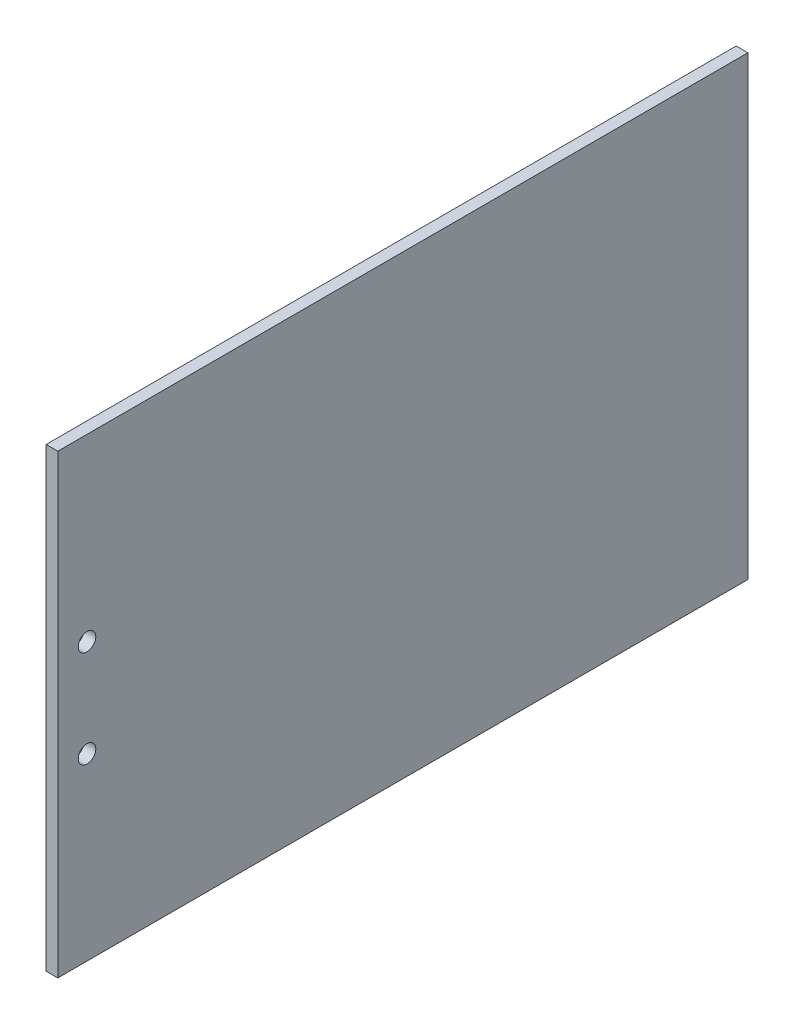
ISO-10303-21;
HEADER;
FILE_DESCRIPTION(('STEP AP214'),'2;1');
FILE_NAME('part.step','',(''),(''),'','','');
FILE_SCHEMA(('AUTOMOTIVE_DESIGN { 1 0 10303 214 1 1 1 1 }'));
ENDSEC;
DATA;
#1=APPLICATION_CONTEXT('core data for automotive mechanical design processes');
#2=APPLICATION_PROTOCOL_DEFINITION('international standard','automotive_design',2000,#1);
#3=PRODUCT_CONTEXT('',#1,'mechanical');
#4=PRODUCT('Part','Part','',(#3));
#5=PRODUCT_RELATED_PRODUCT_CATEGORY('part','',(#4));
#6=PRODUCT_DEFINITION_FORMATION('','',#4);
#7=PRODUCT_DEFINITION_CONTEXT('part definition',#1,'design');
#8=PRODUCT_DEFINITION('design','',#6,#7);
#9=PRODUCT_DEFINITION_SHAPE('','',#8);
#10=(LENGTH_UNIT() NAMED_UNIT(*) SI_UNIT(.MILLI.,.METRE.));
#11=(NAMED_UNIT(*) PLANE_ANGLE_UNIT() SI_UNIT($,.RADIAN.));
#12=(NAMED_UNIT(*) SI_UNIT($,.STERADIAN.) SOLID_ANGLE_UNIT());
#13=UNCERTAINTY_MEASURE_WITH_UNIT(LENGTH_MEASURE(1.E-05),#10,'distance_accuracy_value','');
#14=(GEOMETRIC_REPRESENTATION_CONTEXT(3) GLOBAL_UNCERTAINTY_ASSIGNED_CONTEXT((#13)) GLOBAL_UNIT_ASSIGNED_CONTEXT((#10,
#11,#12)) REPRESENTATION_CONTEXT('',''));
#15=CARTESIAN_POINT('',(0.,0.,0.));
#16=DIRECTION('',(0.,0.,1.));
#17=DIRECTION('',(1.,0.,0.));
#18=AXIS2_PLACEMENT_3D('',#15,#16,#17);
#19=CARTESIAN_POINT('',(2.54,0.,0.));
#20=DIRECTION('',(-1.,0.,0.));
#21=DIRECTION('',(0.,0.,1.));
#22=AXIS2_PLACEMENT_3D('',#19,#20,#21);
#23=PLANE('',#22);
#24=DIRECTION('',(0.,-1.,0.));
#25=VECTOR('',#24,1.);
#26=CARTESIAN_POINT('',(2.54,49.53,74.93));
#27=LINE('',#26,#25);
#28=CARTESIAN_POINT('',(2.54,49.53,74.93));
#29=VERTEX_POINT('',#28);
#30=CARTESIAN_POINT('',(2.54,-49.53,74.93));
#31=VERTEX_POINT('',#30);
#32=EDGE_CURVE('E93',#29,#31,#27,.T.);
#33=ORIENTED_EDGE('',*,*,#32,.T.);
#34=DIRECTION('',(0.,0.,-1.));
#35=VECTOR('',#34,1.);
#36=CARTESIAN_POINT('',(2.54,-49.53,-74.93));
#37=LINE('',#36,#35);
#38=CARTESIAN_POINT('',(2.54,-49.53,-74.93));
#39=VERTEX_POINT('',#38);
#40=EDGE_CURVE('E88',#31,#39,#37,.T.);
#41=ORIENTED_EDGE('',*,*,#40,.T.);
#42=DIRECTION('',(0.,1.,0.));
#43=VECTOR('',#42,1.);
#44=CARTESIAN_POINT('',(2.54,49.53,-74.93));
#45=LINE('',#44,#43);
#46=CARTESIAN_POINT('',(2.54,49.53,-74.93));
#47=VERTEX_POINT('',#46);
#48=EDGE_CURVE('E91',#39,#47,#45,.T.);
#49=ORIENTED_EDGE('',*,*,#48,.T.);
#50=DIRECTION('',(0.,0.,1.));
#51=VECTOR('',#50,1.);
#52=CARTESIAN_POINT('',(2.54,49.53,-74.93));
#53=LINE('',#52,#51);
#54=EDGE_CURVE('E58',#47,#29,#53,.T.);
#55=ORIENTED_EDGE('',*,*,#54,.T.);
#56=EDGE_LOOP('',(#33,#41,#49,#55));
#57=FACE_BOUND('',#56,.T.);
#58=CARTESIAN_POINT('',(2.54,10.541,68.58));
#59=DIRECTION('',(1.,0.,0.));
#60=DIRECTION('',(0.,0.,-1.));
#61=AXIS2_PLACEMENT_3D('',#58,#59,#60);
#62=CIRCLE('',#61,1.90500000000001);
#63=CARTESIAN_POINT('',(2.54,10.541,66.675));
#64=VERTEX_POINT('',#63);
#65=EDGE_CURVE('E108',#64,#64,#62,.T.);
#66=ORIENTED_EDGE('',*,*,#65,.F.);
#67=EDGE_LOOP('',(#66));
#68=FACE_BOUND('',#67,.T.);
#69=CARTESIAN_POINT('',(2.54,-10.541,68.58));
#70=DIRECTION('',(1.,0.,0.));
#71=DIRECTION('',(0.,0.,-1.));
#72=AXIS2_PLACEMENT_3D('',#69,#70,#71);
#73=CIRCLE('',#72,1.90500000000001);
#74=CARTESIAN_POINT('',(2.54,-10.541,66.675));
#75=VERTEX_POINT('',#74);
#76=EDGE_CURVE('E123',#75,#75,#73,.T.);
#77=ORIENTED_EDGE('',*,*,#76,.F.);
#78=EDGE_LOOP('',(#77));
#79=FACE_BOUND('',#78,.T.);
#80=ADVANCED_FACE('F41',(#57,#68,#79),#23,.F.);
#81=CARTESIAN_POINT('',(0.,0.,0.));
#82=DIRECTION('',(-1.,0.,0.));
#83=DIRECTION('',(0.,0.,1.));
#84=AXIS2_PLACEMENT_3D('',#81,#82,#83);
#85=PLANE('',#84);
#86=CARTESIAN_POINT('',(0.,10.541,68.58));
#87=DIRECTION('',(1.,0.,0.));
#88=DIRECTION('',(0.,0.,-1.));
#89=AXIS2_PLACEMENT_3D('',#86,#87,#88);
#90=CIRCLE('',#89,1.90500000000001);
#91=CARTESIAN_POINT('',(0.,10.541,66.675));
#92=VERTEX_POINT('',#91);
#93=EDGE_CURVE('E120',#92,#92,#90,.T.);
#94=ORIENTED_EDGE('',*,*,#93,.T.);
#95=EDGE_LOOP('',(#94));
#96=FACE_BOUND('',#95,.T.);
#97=DIRECTION('',(0.,-1.,0.));
#98=VECTOR('',#97,1.);
#99=CARTESIAN_POINT('',(0.,49.53,74.93));
#100=LINE('',#99,#98);
#101=CARTESIAN_POINT('',(0.,49.53,74.93));
#102=VERTEX_POINT('',#101);
#103=CARTESIAN_POINT('',(0.,-49.53,74.93));
#104=VERTEX_POINT('',#103);
#105=EDGE_CURVE('E105',#102,#104,#100,.T.);
#106=ORIENTED_EDGE('',*,*,#105,.F.);
#107=DIRECTION('',(0.,0.,1.));
#108=VECTOR('',#107,1.);
#109=CARTESIAN_POINT('',(0.,49.53,-74.93));
#110=LINE('',#109,#108);
#111=CARTESIAN_POINT('',(0.,49.53,-74.93));
#112=VERTEX_POINT('',#111);
#113=EDGE_CURVE('E81',#112,#102,#110,.T.);
#114=ORIENTED_EDGE('',*,*,#113,.F.);
#115=DIRECTION('',(0.,1.,0.));
#116=VECTOR('',#115,1.);
#117=CARTESIAN_POINT('',(0.,49.53,-74.93));
#118=LINE('',#117,#116);
#119=CARTESIAN_POINT('',(0.,-49.53,-74.93));
#120=VERTEX_POINT('',#119);
#121=EDGE_CURVE('E75',#120,#112,#118,.T.);
#122=ORIENTED_EDGE('',*,*,#121,.F.);
#123=DIRECTION('',(0.,0.,-1.));
#124=VECTOR('',#123,1.);
#125=CARTESIAN_POINT('',(0.,-49.53,-74.93));
#126=LINE('',#125,#124);
#127=EDGE_CURVE('E97',#104,#120,#126,.T.);
#128=ORIENTED_EDGE('',*,*,#127,.F.);
#129=EDGE_LOOP('',(#106,#114,#122,#128));
#130=FACE_BOUND('',#129,.T.);
#131=CARTESIAN_POINT('',(0.,-10.541,68.58));
#132=DIRECTION('',(1.,0.,0.));
#133=DIRECTION('',(0.,0.,-1.));
#134=AXIS2_PLACEMENT_3D('',#131,#132,#133);
#135=CIRCLE('',#134,1.90500000000001);
#136=CARTESIAN_POINT('',(0.,-10.541,66.675));
#137=VERTEX_POINT('',#136);
#138=EDGE_CURVE('E126',#137,#137,#135,.T.);
#139=ORIENTED_EDGE('',*,*,#138,.T.);
#140=EDGE_LOOP('',(#139));
#141=FACE_BOUND('',#140,.T.);
#142=ADVANCED_FACE('F116',(#96,#130,#141),#85,.T.);
#143=CARTESIAN_POINT('',(2.54,49.53,74.93));
#144=DIRECTION('',(0.,0.,-1.));
#145=DIRECTION('',(-1.,0.,0.));
#146=AXIS2_PLACEMENT_3D('',#143,#144,#145);
#147=PLANE('',#146);
#148=ORIENTED_EDGE('',*,*,#105,.T.);
#149=DIRECTION('',(-1.,0.,0.));
#150=VECTOR('',#149,1.);
#151=CARTESIAN_POINT('',(2.54,-49.53,74.93));
#152=LINE('',#151,#150);
#153=EDGE_CURVE('E11',#31,#104,#152,.T.);
#154=ORIENTED_EDGE('',*,*,#153,.F.);
#155=ORIENTED_EDGE('',*,*,#32,.F.);
#156=DIRECTION('',(-1.,0.,0.));
#157=VECTOR('',#156,1.);
#158=CARTESIAN_POINT('',(2.54,49.53,74.93));
#159=LINE('',#158,#157);
#160=EDGE_CURVE('E101',#29,#102,#159,.T.);
#161=ORIENTED_EDGE('',*,*,#160,.T.);
#162=EDGE_LOOP('',(#148,#154,#155,#161));
#163=FACE_BOUND('',#162,.T.);
#164=ADVANCED_FACE('F43',(#163),#147,.F.);
#165=CARTESIAN_POINT('',(2.54,-49.53,-74.93));
#166=DIRECTION('',(0.,1.,0.));
#167=DIRECTION('',(0.,0.,1.));
#168=AXIS2_PLACEMENT_3D('',#165,#166,#167);
#169=PLANE('',#168);
#170=ORIENTED_EDGE('',*,*,#127,.T.);
#171=DIRECTION('',(-1.,0.,0.));
#172=VECTOR('',#171,1.);
#173=CARTESIAN_POINT('',(2.54,-49.53,-74.93));
#174=LINE('',#173,#172);
#175=EDGE_CURVE('E50',#39,#120,#174,.T.);
#176=ORIENTED_EDGE('',*,*,#175,.F.);
#177=ORIENTED_EDGE('',*,*,#40,.F.);
#178=ORIENTED_EDGE('',*,*,#153,.T.);
#179=EDGE_LOOP('',(#170,#176,#177,#178));
#180=FACE_BOUND('',#179,.T.);
#181=ADVANCED_FACE('F96',(#180),#169,.F.);
#182=CARTESIAN_POINT('',(2.54,49.53,-74.93));
#183=DIRECTION('',(0.,0.,1.));
#184=DIRECTION('',(0.,-1.,0.));
#185=AXIS2_PLACEMENT_3D('',#182,#183,#184);
#186=PLANE('',#185);
#187=ORIENTED_EDGE('',*,*,#121,.T.);
#188=DIRECTION('',(-1.,0.,0.));
#189=VECTOR('',#188,1.);
#190=CARTESIAN_POINT('',(2.54,49.53,-74.93));
#191=LINE('',#190,#189);
#192=EDGE_CURVE('E98',#47,#112,#191,.T.);
#193=ORIENTED_EDGE('',*,*,#192,.F.);
#194=ORIENTED_EDGE('',*,*,#48,.F.);
#195=ORIENTED_EDGE('',*,*,#175,.T.);
#196=EDGE_LOOP('',(#187,#193,#194,#195));
#197=FACE_BOUND('',#196,.T.);
#198=ADVANCED_FACE('F99',(#197),#186,.F.);
#199=CARTESIAN_POINT('',(2.54,49.53,-74.93));
#200=DIRECTION('',(0.,-1.,0.));
#201=DIRECTION('',(0.,0.,-1.));
#202=AXIS2_PLACEMENT_3D('',#199,#200,#201);
#203=PLANE('',#202);
#204=ORIENTED_EDGE('',*,*,#113,.T.);
#205=ORIENTED_EDGE('',*,*,#160,.F.);
#206=ORIENTED_EDGE('',*,*,#54,.F.);
#207=ORIENTED_EDGE('',*,*,#192,.T.);
#208=EDGE_LOOP('',(#204,#205,#206,#207));
#209=FACE_BOUND('',#208,.T.);
#210=ADVANCED_FACE('F113',(#209),#203,.F.);
#211=CARTESIAN_POINT('',(2.54,10.541,68.58));
#212=DIRECTION('',(-1.,0.,0.));
#213=DIRECTION('',(0.,0.,1.));
#214=AXIS2_PLACEMENT_3D('',#211,#212,#213);
#215=CYLINDRICAL_SURFACE('',#214,1.90500000000001);
#216=ORIENTED_EDGE('',*,*,#65,.T.);
#217=EDGE_LOOP('',(#216));
#218=FACE_BOUND('',#217,.T.);
#219=ORIENTED_EDGE('',*,*,#93,.F.);
#220=EDGE_LOOP('',(#219));
#221=FACE_BOUND('',#220,.T.);
#222=ADVANCED_FACE('F143',(#218,#221),#215,.F.);
#223=CARTESIAN_POINT('',(2.54,-10.541,68.58));
#224=DIRECTION('',(-1.,0.,0.));
#225=DIRECTION('',(0.,0.,1.));
#226=AXIS2_PLACEMENT_3D('',#223,#224,#225);
#227=CYLINDRICAL_SURFACE('',#226,1.90500000000001);
#228=ORIENTED_EDGE('',*,*,#76,.T.);
#229=EDGE_LOOP('',(#228));
#230=FACE_BOUND('',#229,.T.);
#231=ORIENTED_EDGE('',*,*,#138,.F.);
#232=EDGE_LOOP('',(#231));
#233=FACE_BOUND('',#232,.T.);
#234=ADVANCED_FACE('F132',(#230,#233),#227,.F.);
#235=CLOSED_SHELL('',(#80,#142,#164,#181,#198,#210,#222,#234));
#236=MANIFOLD_SOLID_BREP('B2',#235);
#237=ADVANCED_BREP_SHAPE_REPRESENTATION('',(#18,#236),#14);
#238=SHAPE_DEFINITION_REPRESENTATION(#9,#237);
ENDSEC;
END-ISO-10303-21;
